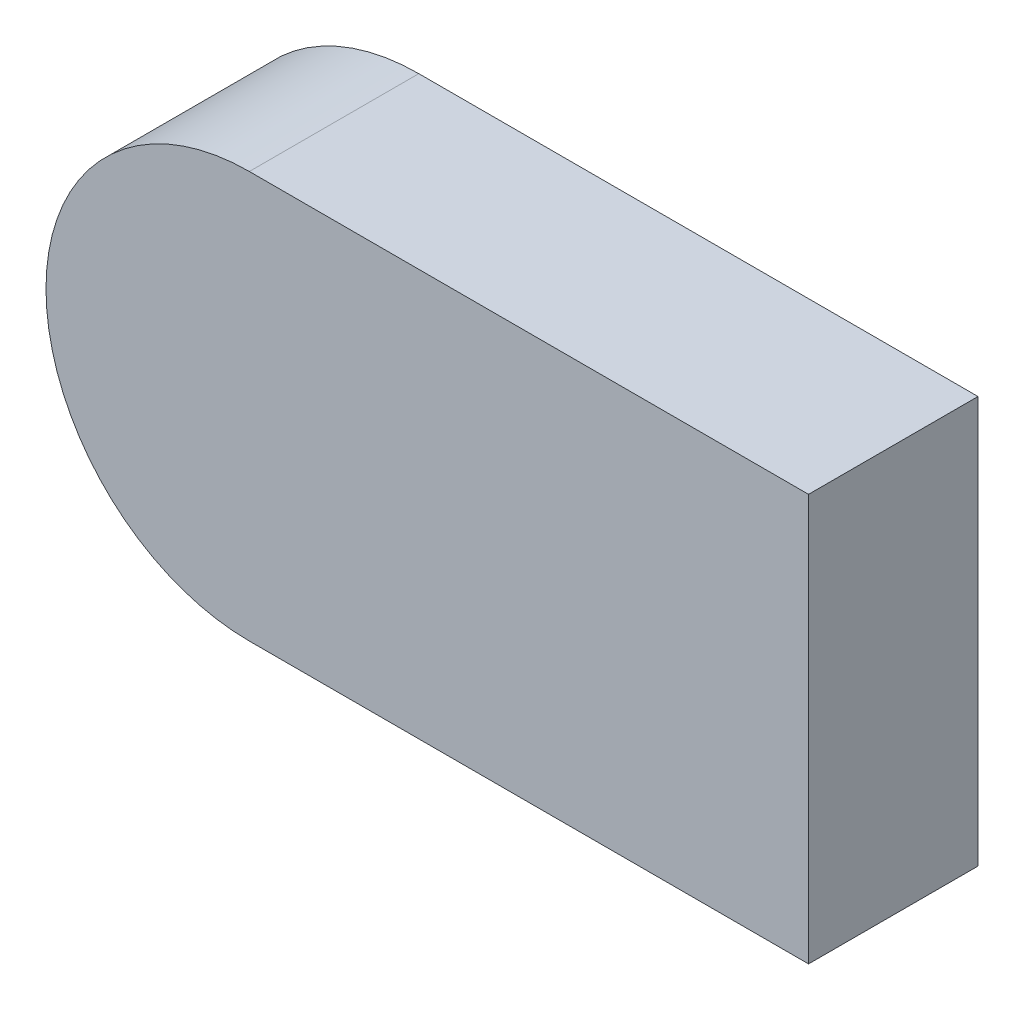
ISO-10303-21;
HEADER;
FILE_DESCRIPTION(('STEP AP214'),'2;1');
FILE_NAME('part.step','',(''),(''),'','','');
FILE_SCHEMA(('AUTOMOTIVE_DESIGN { 1 0 10303 214 1 1 1 1 }'));
ENDSEC;
DATA;
#1=APPLICATION_CONTEXT('core data for automotive mechanical design processes');
#2=APPLICATION_PROTOCOL_DEFINITION('international standard','automotive_design',2000,#1);
#3=PRODUCT_CONTEXT('',#1,'mechanical');
#4=PRODUCT('Part','Part','',(#3));
#5=PRODUCT_RELATED_PRODUCT_CATEGORY('part','',(#4));
#6=PRODUCT_DEFINITION_FORMATION('','',#4);
#7=PRODUCT_DEFINITION_CONTEXT('part definition',#1,'design');
#8=PRODUCT_DEFINITION('design','',#6,#7);
#9=PRODUCT_DEFINITION_SHAPE('','',#8);
#10=(LENGTH_UNIT() NAMED_UNIT(*) SI_UNIT(.MILLI.,.METRE.));
#11=(NAMED_UNIT(*) PLANE_ANGLE_UNIT() SI_UNIT($,.RADIAN.));
#12=(NAMED_UNIT(*) SI_UNIT($,.STERADIAN.) SOLID_ANGLE_UNIT());
#13=UNCERTAINTY_MEASURE_WITH_UNIT(LENGTH_MEASURE(1.E-05),#10,'distance_accuracy_value','');
#14=(GEOMETRIC_REPRESENTATION_CONTEXT(3) GLOBAL_UNCERTAINTY_ASSIGNED_CONTEXT((#13)) GLOBAL_UNIT_ASSIGNED_CONTEXT((#10,
#11,#12)) REPRESENTATION_CONTEXT('',''));
#15=CARTESIAN_POINT('',(0.,0.,0.));
#16=DIRECTION('',(0.,0.,1.));
#17=DIRECTION('',(1.,0.,0.));
#18=AXIS2_PLACEMENT_3D('',#15,#16,#17);
#19=CARTESIAN_POINT('',(4.05,-3.37,0.));
#20=DIRECTION('',(0.,-1.,0.));
#21=DIRECTION('',(-1.,0.,0.));
#22=AXIS2_PLACEMENT_3D('',#19,#20,#21);
#23=PLANE('',#22);
#24=DIRECTION('',(0.,0.,1.));
#25=VECTOR('',#24,1.);
#26=CARTESIAN_POINT('',(4.05,-3.37,0.));
#27=LINE('',#26,#25);
#28=CARTESIAN_POINT('',(4.05,-3.37,0.));
#29=VERTEX_POINT('',#28);
#30=CARTESIAN_POINT('',(4.05,-3.37,0.1));
#31=VERTEX_POINT('',#30);
#32=EDGE_CURVE('E11',#29,#31,#27,.T.);
#33=ORIENTED_EDGE('',*,*,#32,.T.);
#34=DIRECTION('',(-1.,0.,0.));
#35=VECTOR('',#34,1.);
#36=CARTESIAN_POINT('',(4.05,-3.37,0.1));
#37=LINE('',#36,#35);
#38=CARTESIAN_POINT('',(3.72,-3.37,0.1));
#39=VERTEX_POINT('',#38);
#40=EDGE_CURVE('E24',#31,#39,#37,.T.);
#41=ORIENTED_EDGE('',*,*,#40,.T.);
#42=DIRECTION('',(0.,0.,1.));
#43=VECTOR('',#42,1.);
#44=CARTESIAN_POINT('',(3.72,-3.37,0.));
#45=LINE('',#44,#43);
#46=CARTESIAN_POINT('',(3.72,-3.37,0.));
#47=VERTEX_POINT('',#46);
#48=EDGE_CURVE('E86',#47,#39,#45,.T.);
#49=ORIENTED_EDGE('',*,*,#48,.F.);
#50=DIRECTION('',(-1.,0.,0.));
#51=VECTOR('',#50,1.);
#52=CARTESIAN_POINT('',(4.05,-3.37,0.));
#53=LINE('',#52,#51);
#54=EDGE_CURVE('E83',#29,#47,#53,.T.);
#55=ORIENTED_EDGE('',*,*,#54,.F.);
#56=EDGE_LOOP('',(#33,#41,#49,#55));
#57=FACE_BOUND('',#56,.T.);
#58=ADVANCED_FACE('F17',(#57),#23,.T.);
#59=CARTESIAN_POINT('',(3.72,-3.25,0.));
#60=DIRECTION('',(0.,0.,-1.));
#61=DIRECTION('',(1.,0.,0.));
#62=AXIS2_PLACEMENT_3D('',#59,#60,#61);
#63=CYLINDRICAL_SURFACE('',#62,0.12);
#64=CARTESIAN_POINT('',(3.72,-3.25,0.));
#65=DIRECTION('',(0.,0.,1.));
#66=DIRECTION('',(1.,0.,0.));
#67=AXIS2_PLACEMENT_3D('',#64,#65,#66);
#68=CIRCLE('',#67,0.12);
#69=CARTESIAN_POINT('',(3.72,-3.13,0.));
#70=VERTEX_POINT('',#69);
#71=EDGE_CURVE('E80',#70,#47,#68,.T.);
#72=ORIENTED_EDGE('',*,*,#71,.T.);
#73=ORIENTED_EDGE('',*,*,#48,.T.);
#74=CARTESIAN_POINT('',(3.72,-3.25,0.1));
#75=DIRECTION('',(0.,0.,1.));
#76=DIRECTION('',(1.,0.,0.));
#77=AXIS2_PLACEMENT_3D('',#74,#75,#76);
#78=CIRCLE('',#77,0.12);
#79=CARTESIAN_POINT('',(3.72,-3.13,0.1));
#80=VERTEX_POINT('',#79);
#81=EDGE_CURVE('E78',#80,#39,#78,.T.);
#82=ORIENTED_EDGE('',*,*,#81,.F.);
#83=DIRECTION('',(0.,0.,1.));
#84=VECTOR('',#83,1.);
#85=CARTESIAN_POINT('',(3.72,-3.13,0.));
#86=LINE('',#85,#84);
#87=EDGE_CURVE('E67',#70,#80,#86,.T.);
#88=ORIENTED_EDGE('',*,*,#87,.F.);
#89=EDGE_LOOP('',(#72,#73,#82,#88));
#90=FACE_BOUND('',#89,.T.);
#91=ADVANCED_FACE('F89',(#90),#63,.T.);
#92=CARTESIAN_POINT('',(4.05,-3.13,0.));
#93=DIRECTION('',(0.,-1.,0.));
#94=DIRECTION('',(-1.,0.,0.));
#95=AXIS2_PLACEMENT_3D('',#92,#93,#94);
#96=PLANE('',#95);
#97=DIRECTION('',(-1.,0.,0.));
#98=VECTOR('',#97,1.);
#99=CARTESIAN_POINT('',(4.05,-3.13,0.));
#100=LINE('',#99,#98);
#101=CARTESIAN_POINT('',(4.05,-3.13,0.));
#102=VERTEX_POINT('',#101);
#103=EDGE_CURVE('E70',#102,#70,#100,.T.);
#104=ORIENTED_EDGE('',*,*,#103,.T.);
#105=ORIENTED_EDGE('',*,*,#87,.T.);
#106=DIRECTION('',(-1.,0.,0.));
#107=VECTOR('',#106,1.);
#108=CARTESIAN_POINT('',(4.05,-3.13,0.1));
#109=LINE('',#108,#107);
#110=CARTESIAN_POINT('',(4.05,-3.13,0.1));
#111=VERTEX_POINT('',#110);
#112=EDGE_CURVE('E61',#111,#80,#109,.T.);
#113=ORIENTED_EDGE('',*,*,#112,.F.);
#114=DIRECTION('',(0.,0.,1.));
#115=VECTOR('',#114,1.);
#116=CARTESIAN_POINT('',(4.05,-3.13,0.));
#117=LINE('',#116,#115);
#118=EDGE_CURVE('E51',#102,#111,#117,.T.);
#119=ORIENTED_EDGE('',*,*,#118,.F.);
#120=EDGE_LOOP('',(#104,#105,#113,#119));
#121=FACE_BOUND('',#120,.T.);
#122=ADVANCED_FACE('F65',(#121),#96,.F.);
#123=CARTESIAN_POINT('',(4.05,-3.37,0.));
#124=DIRECTION('',(-1.,0.,0.));
#125=DIRECTION('',(0.,1.,0.));
#126=AXIS2_PLACEMENT_3D('',#123,#124,#125);
#127=PLANE('',#126);
#128=DIRECTION('',(0.,1.,0.));
#129=VECTOR('',#128,1.);
#130=CARTESIAN_POINT('',(4.05,-3.37,0.));
#131=LINE('',#130,#129);
#132=EDGE_CURVE('E57',#29,#102,#131,.T.);
#133=ORIENTED_EDGE('',*,*,#132,.T.);
#134=ORIENTED_EDGE('',*,*,#118,.T.);
#135=DIRECTION('',(0.,1.,0.));
#136=VECTOR('',#135,1.);
#137=CARTESIAN_POINT('',(4.05,-3.37,0.1));
#138=LINE('',#137,#136);
#139=EDGE_CURVE('E55',#31,#111,#138,.T.);
#140=ORIENTED_EDGE('',*,*,#139,.F.);
#141=ORIENTED_EDGE('',*,*,#32,.F.);
#142=EDGE_LOOP('',(#133,#134,#140,#141));
#143=FACE_BOUND('',#142,.T.);
#144=ADVANCED_FACE('F53',(#143),#127,.F.);
#145=CARTESIAN_POINT('',(3.849490847913,-3.25,0.));
#146=DIRECTION('',(0.,0.,-1.));
#147=DIRECTION('',(-1.,0.,0.));
#148=AXIS2_PLACEMENT_3D('',#145,#146,#147);
#149=PLANE('',#148);
#150=ORIENTED_EDGE('',*,*,#54,.T.);
#151=ORIENTED_EDGE('',*,*,#71,.F.);
#152=ORIENTED_EDGE('',*,*,#103,.F.);
#153=ORIENTED_EDGE('',*,*,#132,.F.);
#154=EDGE_LOOP('',(#150,#151,#152,#153));
#155=FACE_BOUND('',#154,.T.);
#156=ADVANCED_FACE('F91',(#155),#149,.T.);
#157=CARTESIAN_POINT('',(3.849490847913,-3.25,0.1));
#158=DIRECTION('',(0.,0.,-1.));
#159=DIRECTION('',(-1.,0.,0.));
#160=AXIS2_PLACEMENT_3D('',#157,#158,#159);
#161=PLANE('',#160);
#162=ORIENTED_EDGE('',*,*,#139,.T.);
#163=ORIENTED_EDGE('',*,*,#112,.T.);
#164=ORIENTED_EDGE('',*,*,#81,.T.);
#165=ORIENTED_EDGE('',*,*,#40,.F.);
#166=EDGE_LOOP('',(#162,#163,#164,#165));
#167=FACE_BOUND('',#166,.T.);
#168=ADVANCED_FACE('F72',(#167),#161,.F.);
#169=CLOSED_SHELL('',(#58,#91,#122,#144,#156,#168));
#170=MANIFOLD_SOLID_BREP('B1',#169);
#171=ADVANCED_BREP_SHAPE_REPRESENTATION('',(#18,#170),#14);
#172=SHAPE_DEFINITION_REPRESENTATION(#9,#171);
ENDSEC;
END-ISO-10303-21;
